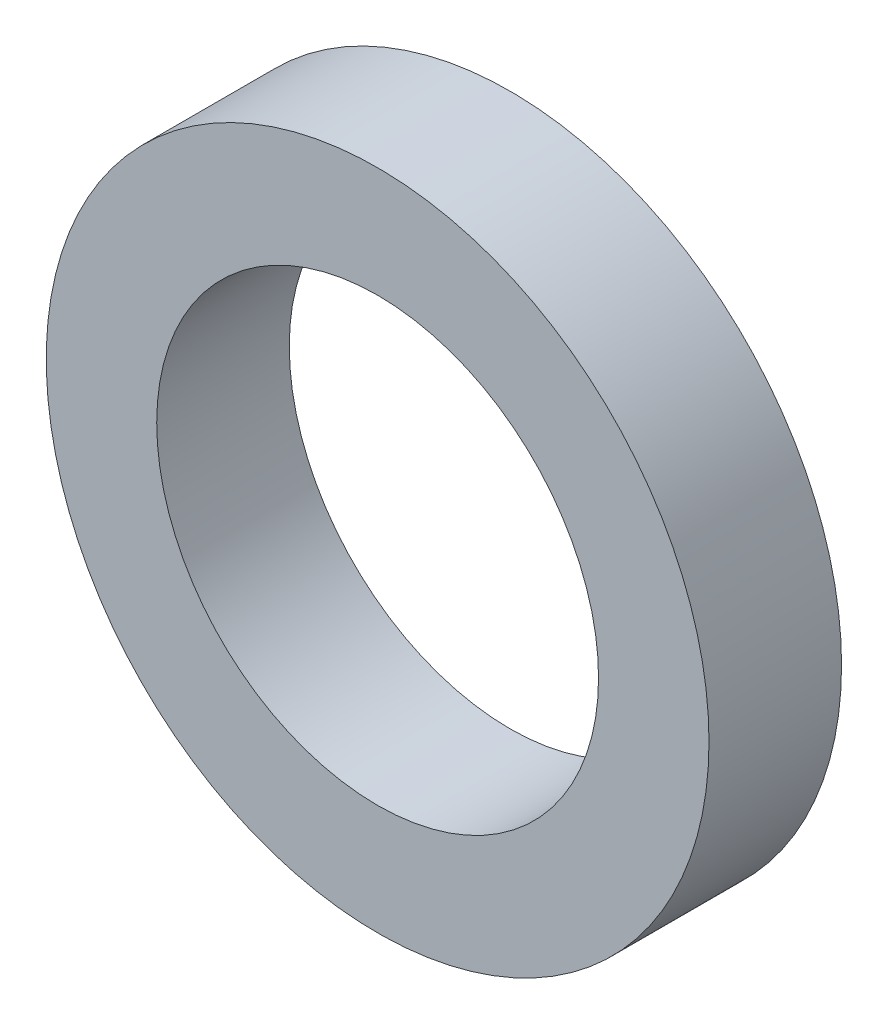
ISO-10303-21;
HEADER;
FILE_DESCRIPTION(('STEP AP214'),'2;1');
FILE_NAME('part.step','',(''),(''),'','','');
FILE_SCHEMA(('AUTOMOTIVE_DESIGN { 1 0 10303 214 1 1 1 1 }'));
ENDSEC;
DATA;
#1=APPLICATION_CONTEXT('core data for automotive mechanical design processes');
#2=APPLICATION_PROTOCOL_DEFINITION('international standard','automotive_design',2000,#1);
#3=PRODUCT_CONTEXT('',#1,'mechanical');
#4=PRODUCT('Part','Part','',(#3));
#5=PRODUCT_RELATED_PRODUCT_CATEGORY('part','',(#4));
#6=PRODUCT_DEFINITION_FORMATION('','',#4);
#7=PRODUCT_DEFINITION_CONTEXT('part definition',#1,'design');
#8=PRODUCT_DEFINITION('design','',#6,#7);
#9=PRODUCT_DEFINITION_SHAPE('','',#8);
#10=(LENGTH_UNIT() NAMED_UNIT(*) SI_UNIT(.MILLI.,.METRE.));
#11=(NAMED_UNIT(*) PLANE_ANGLE_UNIT() SI_UNIT($,.RADIAN.));
#12=(NAMED_UNIT(*) SI_UNIT($,.STERADIAN.) SOLID_ANGLE_UNIT());
#13=UNCERTAINTY_MEASURE_WITH_UNIT(LENGTH_MEASURE(1.E-05),#10,'distance_accuracy_value','');
#14=(GEOMETRIC_REPRESENTATION_CONTEXT(3) GLOBAL_UNCERTAINTY_ASSIGNED_CONTEXT((#13)) GLOBAL_UNIT_ASSIGNED_CONTEXT((#10,
#11,#12)) REPRESENTATION_CONTEXT('',''));
#15=CARTESIAN_POINT('',(0.,0.,0.));
#16=DIRECTION('',(0.,0.,1.));
#17=DIRECTION('',(1.,0.,0.));
#18=AXIS2_PLACEMENT_3D('',#15,#16,#17);
#19=CARTESIAN_POINT('',(0.,0.,3.));
#20=DIRECTION('',(0.,0.,1.));
#21=DIRECTION('',(1.,0.,0.));
#22=AXIS2_PLACEMENT_3D('',#19,#20,#21);
#23=PLANE('',#22);
#24=CARTESIAN_POINT('',(0.,0.,3.));
#25=DIRECTION('',(0.,0.,1.));
#26=DIRECTION('',(1.,0.,0.));
#27=AXIS2_PLACEMENT_3D('',#24,#25,#26);
#28=CIRCLE('',#27,7.5);
#29=CARTESIAN_POINT('',(7.5,0.,3.));
#30=VERTEX_POINT('',#29);
#31=EDGE_CURVE('E10',#30,#30,#28,.T.);
#32=ORIENTED_EDGE('',*,*,#31,.T.);
#33=EDGE_LOOP('',(#32));
#34=FACE_BOUND('',#33,.T.);
#35=CARTESIAN_POINT('',(0.,0.,3.));
#36=DIRECTION('',(0.,0.,1.));
#37=DIRECTION('',(1.,0.,0.));
#38=AXIS2_PLACEMENT_3D('',#35,#36,#37);
#39=CIRCLE('',#38,5.);
#40=CARTESIAN_POINT('',(5.,0.,3.));
#41=VERTEX_POINT('',#40);
#42=EDGE_CURVE('E55',#41,#41,#39,.T.);
#43=ORIENTED_EDGE('',*,*,#42,.F.);
#44=EDGE_LOOP('',(#43));
#45=FACE_BOUND('',#44,.T.);
#46=ADVANCED_FACE('F42',(#34,#45),#23,.T.);
#47=CARTESIAN_POINT('',(0.,0.,0.));
#48=DIRECTION('',(0.,0.,1.));
#49=DIRECTION('',(1.,0.,0.));
#50=AXIS2_PLACEMENT_3D('',#47,#48,#49);
#51=PLANE('',#50);
#52=CARTESIAN_POINT('',(0.,0.,0.));
#53=DIRECTION('',(0.,0.,1.));
#54=DIRECTION('',(1.,0.,0.));
#55=AXIS2_PLACEMENT_3D('',#52,#53,#54);
#56=CIRCLE('',#55,7.5);
#57=CARTESIAN_POINT('',(7.5,0.,0.));
#58=VERTEX_POINT('',#57);
#59=EDGE_CURVE('E46',#58,#58,#56,.T.);
#60=ORIENTED_EDGE('',*,*,#59,.F.);
#61=EDGE_LOOP('',(#60));
#62=FACE_BOUND('',#61,.T.);
#63=CARTESIAN_POINT('',(0.,0.,0.));
#64=DIRECTION('',(0.,0.,1.));
#65=DIRECTION('',(1.,0.,0.));
#66=AXIS2_PLACEMENT_3D('',#63,#64,#65);
#67=CIRCLE('',#66,5.);
#68=CARTESIAN_POINT('',(5.,0.,0.));
#69=VERTEX_POINT('',#68);
#70=EDGE_CURVE('E57',#69,#69,#67,.T.);
#71=ORIENTED_EDGE('',*,*,#70,.T.);
#72=EDGE_LOOP('',(#71));
#73=FACE_BOUND('',#72,.T.);
#74=ADVANCED_FACE('F69',(#62,#73),#51,.F.);
#75=CARTESIAN_POINT('',(0.,0.,3.));
#76=DIRECTION('',(0.,0.,-1.));
#77=DIRECTION('',(-1.,0.,0.));
#78=AXIS2_PLACEMENT_3D('',#75,#76,#77);
#79=CYLINDRICAL_SURFACE('',#78,7.5);
#80=ORIENTED_EDGE('',*,*,#31,.F.);
#81=EDGE_LOOP('',(#80));
#82=FACE_BOUND('',#81,.T.);
#83=ORIENTED_EDGE('',*,*,#59,.T.);
#84=EDGE_LOOP('',(#83));
#85=FACE_BOUND('',#84,.T.);
#86=ADVANCED_FACE('F44',(#82,#85),#79,.T.);
#87=CARTESIAN_POINT('',(0.,0.,3.));
#88=DIRECTION('',(0.,0.,-1.));
#89=DIRECTION('',(-1.,0.,0.));
#90=AXIS2_PLACEMENT_3D('',#87,#88,#89);
#91=CYLINDRICAL_SURFACE('',#90,5.);
#92=ORIENTED_EDGE('',*,*,#42,.T.);
#93=EDGE_LOOP('',(#92));
#94=FACE_BOUND('',#93,.T.);
#95=ORIENTED_EDGE('',*,*,#70,.F.);
#96=EDGE_LOOP('',(#95));
#97=FACE_BOUND('',#96,.T.);
#98=ADVANCED_FACE('F65',(#94,#97),#91,.F.);
#99=CLOSED_SHELL('',(#46,#74,#86,#98));
#100=MANIFOLD_SOLID_BREP('B2',#99);
#101=ADVANCED_BREP_SHAPE_REPRESENTATION('',(#18,#100),#14);
#102=SHAPE_DEFINITION_REPRESENTATION(#9,#101);
ENDSEC;
END-ISO-10303-21;
